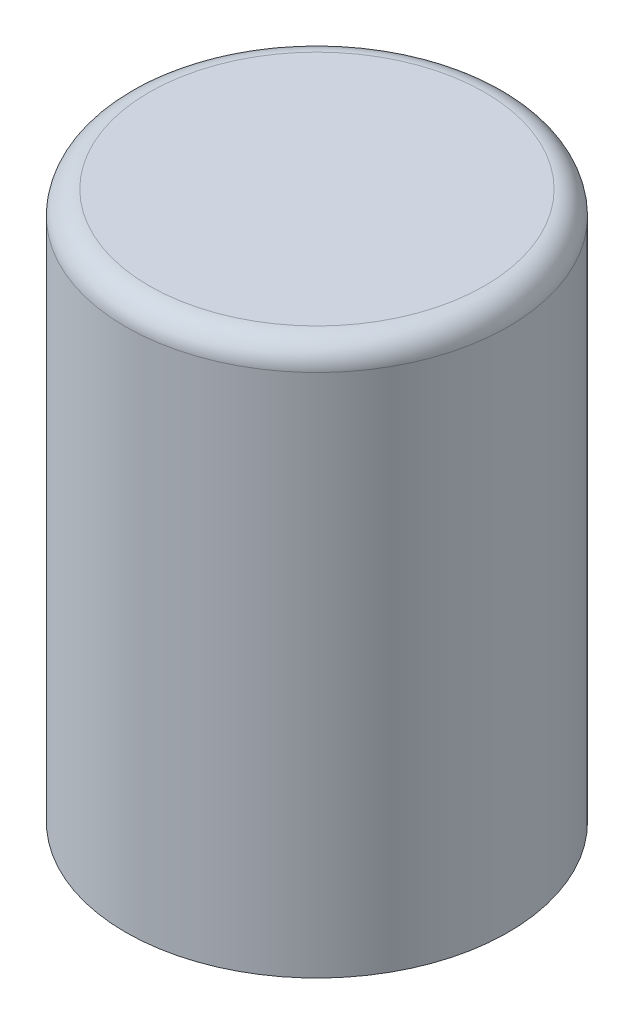
ISO-10303-21;
HEADER;
FILE_DESCRIPTION(('STEP AP214'),'2;1');
FILE_NAME('part.step','',(''),(''),'','','');
FILE_SCHEMA(('AUTOMOTIVE_DESIGN { 1 0 10303 214 1 1 1 1 }'));
ENDSEC;
DATA;
#1=APPLICATION_CONTEXT('core data for automotive mechanical design processes');
#2=APPLICATION_PROTOCOL_DEFINITION('international standard','automotive_design',2000,#1);
#3=PRODUCT_CONTEXT('',#1,'mechanical');
#4=PRODUCT('Part','Part','',(#3));
#5=PRODUCT_RELATED_PRODUCT_CATEGORY('part','',(#4));
#6=PRODUCT_DEFINITION_FORMATION('','',#4);
#7=PRODUCT_DEFINITION_CONTEXT('part definition',#1,'design');
#8=PRODUCT_DEFINITION('design','',#6,#7);
#9=PRODUCT_DEFINITION_SHAPE('','',#8);
#10=(LENGTH_UNIT() NAMED_UNIT(*) SI_UNIT(.MILLI.,.METRE.));
#11=(NAMED_UNIT(*) PLANE_ANGLE_UNIT() SI_UNIT($,.RADIAN.));
#12=(NAMED_UNIT(*) SI_UNIT($,.STERADIAN.) SOLID_ANGLE_UNIT());
#13=UNCERTAINTY_MEASURE_WITH_UNIT(LENGTH_MEASURE(1.E-05),#10,'distance_accuracy_value','');
#14=(GEOMETRIC_REPRESENTATION_CONTEXT(3) GLOBAL_UNCERTAINTY_ASSIGNED_CONTEXT((#13)) GLOBAL_UNIT_ASSIGNED_CONTEXT((#10,
#11,#12)) REPRESENTATION_CONTEXT('',''));
#15=CARTESIAN_POINT('',(0.,0.,0.));
#16=DIRECTION('',(0.,0.,1.));
#17=DIRECTION('',(1.,0.,0.));
#18=AXIS2_PLACEMENT_3D('',#15,#16,#17);
#19=CARTESIAN_POINT('',(-21.96014760778,15.547980609798,-11.48314809185));
#20=DIRECTION('',(0.,1.,0.));
#21=DIRECTION('',(0.,0.,1.));
#22=AXIS2_PLACEMENT_3D('',#19,#20,#21);
#23=PLANE('',#22);
#24=CARTESIAN_POINT('',(-21.96014760778,15.547980609798,-11.48314809185));
#25=DIRECTION('',(0.,-1.,0.));
#26=DIRECTION('',(0.,0.,-1.));
#27=AXIS2_PLACEMENT_3D('',#24,#25,#26);
#28=CIRCLE('',#27,3.55);
#29=CARTESIAN_POINT('',(-21.96014760778,15.547980609798,-15.0331480918488));
#30=VERTEX_POINT('',#29);
#31=CARTESIAN_POINT('',(-21.96014760778,15.547980609798,-7.9331480918536));
#32=VERTEX_POINT('',#31);
#33=EDGE_CURVE('E40',#30,#32,#28,.T.);
#34=ORIENTED_EDGE('',*,*,#33,.F.);
#35=CARTESIAN_POINT('',(-21.96014760778,15.547980609798,-11.48314809185));
#36=DIRECTION('',(0.,-1.,0.));
#37=DIRECTION('',(0.,0.,1.));
#38=AXIS2_PLACEMENT_3D('',#35,#36,#37);
#39=CIRCLE('',#38,3.549999999994);
#40=EDGE_CURVE('E34',#32,#30,#39,.T.);
#41=ORIENTED_EDGE('',*,*,#40,.F.);
#42=EDGE_LOOP('',(#34,#41));
#43=FACE_BOUND('',#42,.T.);
#44=ADVANCED_FACE('F17',(#43),#23,.T.);
#45=CARTESIAN_POINT('',(-21.96014760778,15.047980609798,-11.48314809185));
#46=DIRECTION('',(0.,1.,0.));
#47=DIRECTION('',(0.,0.,1.));
#48=AXIS2_PLACEMENT_3D('',#45,#46,#47);
#49=TOROIDAL_SURFACE('',#48,3.55,0.5);
#50=ORIENTED_EDGE('',*,*,#40,.T.);
#51=ORIENTED_EDGE('',*,*,#33,.T.);
#52=EDGE_LOOP('',(#50,#51));
#53=FACE_BOUND('',#52,.T.);
#54=CARTESIAN_POINT('',(-21.96014760778,15.047980609798,-11.48314809185));
#55=DIRECTION('',(0.,1.,0.));
#56=DIRECTION('',(0.,0.,1.));
#57=AXIS2_PLACEMENT_3D('',#54,#55,#56);
#58=CIRCLE('',#57,4.05);
#59=CARTESIAN_POINT('',(-21.96014760778,15.047980609798,-7.43314809185));
#60=VERTEX_POINT('',#59);
#61=EDGE_CURVE('E27',#60,#60,#58,.F.);
#62=ORIENTED_EDGE('',*,*,#61,.F.);
#63=EDGE_LOOP('',(#62));
#64=FACE_BOUND('',#63,.T.);
#65=ADVANCED_FACE('F38',(#53,#64),#49,.T.);
#66=CARTESIAN_POINT('',(-21.96014760778,3.947980609798,-11.48314809185));
#67=DIRECTION('',(0.,1.,0.));
#68=DIRECTION('',(0.,0.,1.));
#69=AXIS2_PLACEMENT_3D('',#66,#67,#68);
#70=PLANE('',#69);
#71=CARTESIAN_POINT('',(-21.96014760778,3.947980609798,-11.48314809185));
#72=DIRECTION('',(0.,1.,0.));
#73=DIRECTION('',(0.,0.,1.));
#74=AXIS2_PLACEMENT_3D('',#71,#72,#73);
#75=CIRCLE('',#74,4.05);
#76=CARTESIAN_POINT('',(-21.96014760778,3.947980609798,-7.43314809185));
#77=VERTEX_POINT('',#76);
#78=EDGE_CURVE('E11',#77,#77,#75,.T.);
#79=ORIENTED_EDGE('',*,*,#78,.F.);
#80=EDGE_LOOP('',(#79));
#81=FACE_BOUND('',#80,.T.);
#82=ADVANCED_FACE('F73',(#81),#70,.F.);
#83=CARTESIAN_POINT('',(-21.96014760778,15.547980609798,-11.48314809185));
#84=DIRECTION('',(0.,1.,0.));
#85=DIRECTION('',(0.,0.,1.));
#86=AXIS2_PLACEMENT_3D('',#83,#84,#85);
#87=CYLINDRICAL_SURFACE('',#86,4.05);
#88=ORIENTED_EDGE('',*,*,#78,.T.);
#89=EDGE_LOOP('',(#88));
#90=FACE_BOUND('',#89,.T.);
#91=ORIENTED_EDGE('',*,*,#61,.T.);
#92=EDGE_LOOP('',(#91));
#93=FACE_BOUND('',#92,.T.);
#94=ADVANCED_FACE('F77',(#90,#93),#87,.T.);
#95=CLOSED_SHELL('',(#44,#65,#82,#94));
#96=MANIFOLD_SOLID_BREP('B1',#95);
#97=ADVANCED_BREP_SHAPE_REPRESENTATION('',(#18,#96),#14);
#98=SHAPE_DEFINITION_REPRESENTATION(#9,#97);
ENDSEC;
END-ISO-10303-21;
